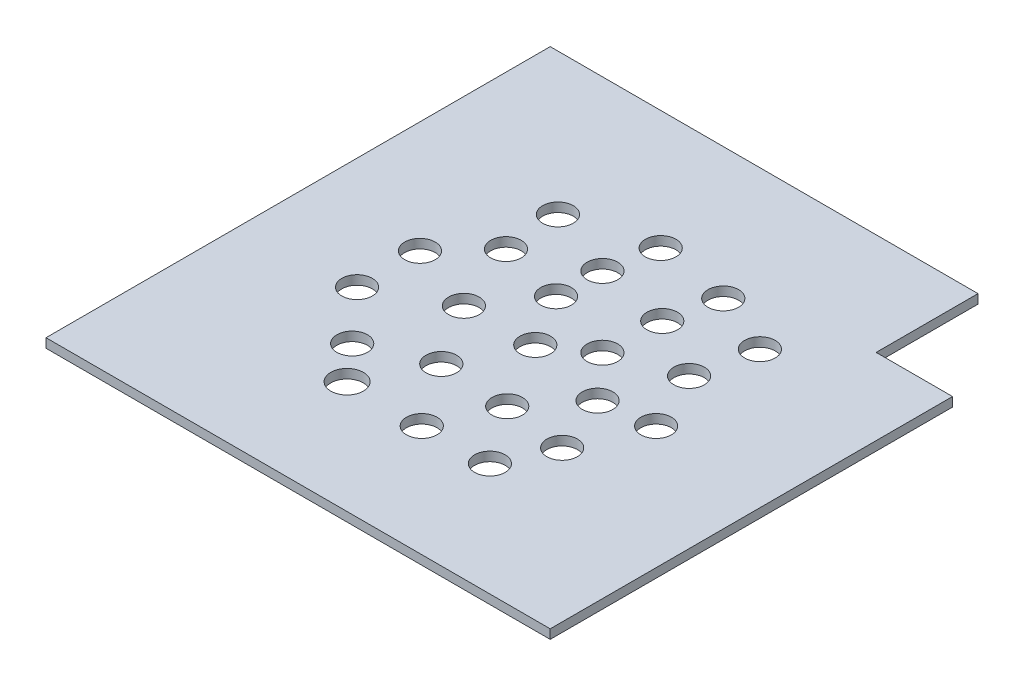
ISO-10303-21;
HEADER;
FILE_DESCRIPTION(('STEP AP214'),'2;1');
FILE_NAME('part.step','',(''),(''),'','','');
FILE_SCHEMA(('AUTOMOTIVE_DESIGN { 1 0 10303 214 1 1 1 1 }'));
ENDSEC;
DATA;
#1=APPLICATION_CONTEXT('core data for automotive mechanical design processes');
#2=APPLICATION_PROTOCOL_DEFINITION('international standard','automotive_design',2000,#1);
#3=PRODUCT_CONTEXT('',#1,'mechanical');
#4=PRODUCT('Part','Part','',(#3));
#5=PRODUCT_RELATED_PRODUCT_CATEGORY('part','',(#4));
#6=PRODUCT_DEFINITION_FORMATION('','',#4);
#7=PRODUCT_DEFINITION_CONTEXT('part definition',#1,'design');
#8=PRODUCT_DEFINITION('design','',#6,#7);
#9=PRODUCT_DEFINITION_SHAPE('','',#8);
#10=(LENGTH_UNIT() NAMED_UNIT(*) SI_UNIT(.MILLI.,.METRE.));
#11=(NAMED_UNIT(*) PLANE_ANGLE_UNIT() SI_UNIT($,.RADIAN.));
#12=(NAMED_UNIT(*) SI_UNIT($,.STERADIAN.) SOLID_ANGLE_UNIT());
#13=UNCERTAINTY_MEASURE_WITH_UNIT(LENGTH_MEASURE(1.E-05),#10,'distance_accuracy_value','');
#14=(GEOMETRIC_REPRESENTATION_CONTEXT(3) GLOBAL_UNCERTAINTY_ASSIGNED_CONTEXT((#13)) GLOBAL_UNIT_ASSIGNED_CONTEXT((#10,
#11,#12)) REPRESENTATION_CONTEXT('',''));
#15=CARTESIAN_POINT('',(0.,0.,0.));
#16=DIRECTION('',(0.,0.,1.));
#17=DIRECTION('',(1.,0.,0.));
#18=AXIS2_PLACEMENT_3D('',#15,#16,#17);
#19=CARTESIAN_POINT('',(0.,1.8,0.));
#20=DIRECTION('',(1.,0.,0.));
#21=DIRECTION('',(0.,0.,-1.));
#22=AXIS2_PLACEMENT_3D('',#19,#20,#21);
#23=PLANE('',#22);
#24=DIRECTION('',(0.,0.,1.));
#25=VECTOR('',#24,1.);
#26=CARTESIAN_POINT('',(0.,0.,0.));
#27=LINE('',#26,#25);
#28=CARTESIAN_POINT('',(0.,0.,-99.));
#29=VERTEX_POINT('',#28);
#30=CARTESIAN_POINT('',(0.,0.,0.));
#31=VERTEX_POINT('',#30);
#32=EDGE_CURVE('E109',#29,#31,#27,.T.);
#33=ORIENTED_EDGE('',*,*,#32,.T.);
#34=DIRECTION('',(0.,-1.,0.));
#35=VECTOR('',#34,1.);
#36=CARTESIAN_POINT('',(0.,1.8,0.));
#37=LINE('',#36,#35);
#38=CARTESIAN_POINT('',(0.,1.8,0.));
#39=VERTEX_POINT('',#38);
#40=EDGE_CURVE('E11',#39,#31,#37,.T.);
#41=ORIENTED_EDGE('',*,*,#40,.F.);
#42=DIRECTION('',(0.,0.,1.));
#43=VECTOR('',#42,1.);
#44=CARTESIAN_POINT('',(0.,1.8,0.));
#45=LINE('',#44,#43);
#46=CARTESIAN_POINT('',(0.,1.8,-99.));
#47=VERTEX_POINT('',#46);
#48=EDGE_CURVE('E110',#47,#39,#45,.T.);
#49=ORIENTED_EDGE('',*,*,#48,.F.);
#50=DIRECTION('',(0.,-1.,0.));
#51=VECTOR('',#50,1.);
#52=CARTESIAN_POINT('',(0.,1.8,-99.));
#53=LINE('',#52,#51);
#54=EDGE_CURVE('E119',#47,#29,#53,.T.);
#55=ORIENTED_EDGE('',*,*,#54,.T.);
#56=EDGE_LOOP('',(#33,#41,#49,#55));
#57=FACE_BOUND('',#56,.T.);
#58=ADVANCED_FACE('F34',(#57),#23,.F.);
#59=CARTESIAN_POINT('',(0.,1.8,0.));
#60=DIRECTION('',(0.,0.,-1.));
#61=DIRECTION('',(-1.,0.,0.));
#62=AXIS2_PLACEMENT_3D('',#59,#60,#61);
#63=PLANE('',#62);
#64=DIRECTION('',(1.,0.,0.));
#65=VECTOR('',#64,1.);
#66=CARTESIAN_POINT('',(0.,0.,0.));
#67=LINE('',#66,#65);
#68=CARTESIAN_POINT('',(99.,0.,0.));
#69=VERTEX_POINT('',#68);
#70=EDGE_CURVE('E115',#31,#69,#67,.T.);
#71=ORIENTED_EDGE('',*,*,#70,.T.);
#72=DIRECTION('',(0.,-1.,0.));
#73=VECTOR('',#72,1.);
#74=CARTESIAN_POINT('',(99.,1.8,0.));
#75=LINE('',#74,#73);
#76=CARTESIAN_POINT('',(99.,1.8,0.));
#77=VERTEX_POINT('',#76);
#78=EDGE_CURVE('E41',#77,#69,#75,.T.);
#79=ORIENTED_EDGE('',*,*,#78,.F.);
#80=DIRECTION('',(1.,0.,0.));
#81=VECTOR('',#80,1.);
#82=CARTESIAN_POINT('',(0.,1.8,0.));
#83=LINE('',#82,#81);
#84=EDGE_CURVE('E80',#39,#77,#83,.T.);
#85=ORIENTED_EDGE('',*,*,#84,.F.);
#86=ORIENTED_EDGE('',*,*,#40,.T.);
#87=EDGE_LOOP('',(#71,#79,#85,#86));
#88=FACE_BOUND('',#87,.T.);
#89=ADVANCED_FACE('F277',(#88),#63,.F.);
#90=CARTESIAN_POINT('',(99.,1.8,0.));
#91=DIRECTION('',(-1.,0.,0.));
#92=DIRECTION('',(0.,0.,1.));
#93=AXIS2_PLACEMENT_3D('',#90,#91,#92);
#94=PLANE('',#93);
#95=DIRECTION('',(0.,0.,-1.));
#96=VECTOR('',#95,1.);
#97=CARTESIAN_POINT('',(99.,0.,0.));
#98=LINE('',#97,#96);
#99=CARTESIAN_POINT('',(99.,0.,-79.));
#100=VERTEX_POINT('',#99);
#101=EDGE_CURVE('E111',#69,#100,#98,.T.);
#102=ORIENTED_EDGE('',*,*,#101,.T.);
#103=DIRECTION('',(0.,1.,0.));
#104=VECTOR('',#103,1.);
#105=CARTESIAN_POINT('',(99.,0.,-79.));
#106=LINE('',#105,#104);
#107=CARTESIAN_POINT('',(99.,1.8,-79.));
#108=VERTEX_POINT('',#107);
#109=EDGE_CURVE('E133',#100,#108,#106,.T.);
#110=ORIENTED_EDGE('',*,*,#109,.T.);
#111=DIRECTION('',(0.,0.,-1.));
#112=VECTOR('',#111,1.);
#113=CARTESIAN_POINT('',(99.,1.8,0.));
#114=LINE('',#113,#112);
#115=EDGE_CURVE('E127',#77,#108,#114,.T.);
#116=ORIENTED_EDGE('',*,*,#115,.F.);
#117=ORIENTED_EDGE('',*,*,#78,.T.);
#118=EDGE_LOOP('',(#102,#110,#116,#117));
#119=FACE_BOUND('',#118,.T.);
#120=ADVANCED_FACE('F124',(#119),#94,.F.);
#121=CARTESIAN_POINT('',(0.,1.8,-99.));
#122=DIRECTION('',(0.,0.,1.));
#123=DIRECTION('',(1.,0.,0.));
#124=AXIS2_PLACEMENT_3D('',#121,#122,#123);
#125=PLANE('',#124);
#126=DIRECTION('',(-1.,0.,0.));
#127=VECTOR('',#126,1.);
#128=CARTESIAN_POINT('',(0.,1.8,-99.));
#129=LINE('',#128,#127);
#130=CARTESIAN_POINT('',(84.,1.8,-99.));
#131=VERTEX_POINT('',#130);
#132=EDGE_CURVE('E57',#131,#47,#129,.T.);
#133=ORIENTED_EDGE('',*,*,#132,.F.);
#134=DIRECTION('',(0.,1.,0.));
#135=VECTOR('',#134,1.);
#136=CARTESIAN_POINT('',(84.,0.,-99.));
#137=LINE('',#136,#135);
#138=CARTESIAN_POINT('',(84.,0.,-99.));
#139=VERTEX_POINT('',#138);
#140=EDGE_CURVE('E98',#139,#131,#137,.T.);
#141=ORIENTED_EDGE('',*,*,#140,.F.);
#142=DIRECTION('',(-1.,0.,0.));
#143=VECTOR('',#142,1.);
#144=CARTESIAN_POINT('',(0.,0.,-99.));
#145=LINE('',#144,#143);
#146=EDGE_CURVE('E75',#139,#29,#145,.T.);
#147=ORIENTED_EDGE('',*,*,#146,.T.);
#148=ORIENTED_EDGE('',*,*,#54,.F.);
#149=EDGE_LOOP('',(#133,#141,#147,#148));
#150=FACE_BOUND('',#149,.T.);
#151=ADVANCED_FACE('F103',(#150),#125,.F.);
#152=CARTESIAN_POINT('',(0.,1.8,0.));
#153=DIRECTION('',(0.,-1.,0.));
#154=DIRECTION('',(0.,0.,-1.));
#155=AXIS2_PLACEMENT_3D('',#152,#153,#154);
#156=PLANE('',#155);
#157=CARTESIAN_POINT('',(57.1772812034631,1.8,-52.0793048172481));
#158=DIRECTION('',(0.,1.,0.));
#159=DIRECTION('',(0.,0.,1.));
#160=AXIS2_PLACEMENT_3D('',#157,#158,#159);
#161=CIRCLE('',#160,3.);
#162=CARTESIAN_POINT('',(57.1772812034631,1.8,-49.0793048172481));
#163=VERTEX_POINT('',#162);
#164=EDGE_CURVE('E135',#163,#163,#161,.T.);
#165=ORIENTED_EDGE('',*,*,#164,.F.);
#166=EDGE_LOOP('',(#165));
#167=FACE_BOUND('',#166,.T.);
#168=CARTESIAN_POINT('',(72.0381119260153,1.8,-68.1385896303287));
#169=DIRECTION('',(0.,1.,0.));
#170=DIRECTION('',(0.,0.,1.));
#171=AXIS2_PLACEMENT_3D('',#168,#169,#170);
#172=CIRCLE('',#171,2.99999999999999);
#173=CARTESIAN_POINT('',(72.0381119260153,1.8,-65.1385896303287));
#174=VERTEX_POINT('',#173);
#175=EDGE_CURVE('E140',#174,#174,#172,.T.);
#176=ORIENTED_EDGE('',*,*,#175,.F.);
#177=EDGE_LOOP('',(#176));
#178=FACE_BOUND('',#177,.T.);
#179=CARTESIAN_POINT('',(37.0432524825859,1.8,-22.0761361103538));
#180=DIRECTION('',(0.,1.,0.));
#181=DIRECTION('',(0.,0.,1.));
#182=AXIS2_PLACEMENT_3D('',#179,#180,#181);
#183=CIRCLE('',#182,3.19787437442162);
#184=CARTESIAN_POINT('',(37.0432524825859,1.8,-18.8782617359322));
#185=VERTEX_POINT('',#184);
#186=EDGE_CURVE('E146',#185,#185,#183,.T.);
#187=ORIENTED_EDGE('',*,*,#186,.F.);
#188=EDGE_LOOP('',(#187));
#189=FACE_BOUND('',#188,.T.);
#190=CARTESIAN_POINT('',(64.9865654797811,1.8,-22.175939832798));
#191=DIRECTION('',(0.,1.,0.));
#192=DIRECTION('',(0.,0.,1.));
#193=AXIS2_PLACEMENT_3D('',#190,#191,#192);
#194=CIRCLE('',#193,2.99999999999999);
#195=CARTESIAN_POINT('',(64.9865654797811,1.8,-19.175939832798));
#196=VERTEX_POINT('',#195);
#197=EDGE_CURVE('E152',#196,#196,#194,.T.);
#198=ORIENTED_EDGE('',*,*,#197,.F.);
#199=EDGE_LOOP('',(#198));
#200=FACE_BOUND('',#199,.T.);
#201=CARTESIAN_POINT('',(74.9144017432835,1.8,-44.8885802740776));
#202=DIRECTION('',(0.,1.,0.));
#203=DIRECTION('',(0.,0.,1.));
#204=AXIS2_PLACEMENT_3D('',#201,#202,#203);
#205=CIRCLE('',#204,2.99999999999999);
#206=CARTESIAN_POINT('',(74.9144017432835,1.8,-41.8885802740776));
#207=VERTEX_POINT('',#206);
#208=EDGE_CURVE('E158',#207,#207,#205,.T.);
#209=ORIENTED_EDGE('',*,*,#208,.F.);
#210=EDGE_LOOP('',(#209));
#211=FACE_BOUND('',#210,.T.);
#212=CARTESIAN_POINT('',(21.942730941928,1.8,-51.4839425456628));
#213=DIRECTION('',(0.,1.,0.));
#214=DIRECTION('',(0.,0.,1.));
#215=AXIS2_PLACEMENT_3D('',#212,#213,#214);
#216=CIRCLE('',#215,3.);
#217=CARTESIAN_POINT('',(21.942730941928,1.8,-48.4839425456628));
#218=VERTEX_POINT('',#217);
#219=EDGE_CURVE('E164',#218,#218,#216,.T.);
#220=ORIENTED_EDGE('',*,*,#219,.F.);
#221=EDGE_LOOP('',(#220));
#222=FACE_BOUND('',#221,.T.);
#223=CARTESIAN_POINT('',(21.942730941928,1.8,-39.1360006395413));
#224=DIRECTION('',(0.,1.,0.));
#225=DIRECTION('',(0.,0.,1.));
#226=AXIS2_PLACEMENT_3D('',#223,#224,#225);
#227=CIRCLE('',#226,3.);
#228=CARTESIAN_POINT('',(21.942730941928,1.8,-36.1360006395413));
#229=VERTEX_POINT('',#228);
#230=EDGE_CURVE('E170',#229,#229,#227,.T.);
#231=ORIENTED_EDGE('',*,*,#230,.F.);
#232=EDGE_LOOP('',(#231));
#233=FACE_BOUND('',#232,.T.);
#234=CARTESIAN_POINT('',(51.9040832051381,1.8,-21.8782617359322));
#235=DIRECTION('',(0.,1.,0.));
#236=DIRECTION('',(0.,0.,1.));
#237=AXIS2_PLACEMENT_3D('',#234,#235,#236);
#238=CIRCLE('',#237,3.);
#239=CARTESIAN_POINT('',(51.9040832051381,1.8,-18.8782617359322));
#240=VERTEX_POINT('',#239);
#241=EDGE_CURVE('E176',#240,#240,#238,.T.);
#242=ORIENTED_EDGE('',*,*,#241,.F.);
#243=EDGE_LOOP('',(#242));
#244=FACE_BOUND('',#243,.T.);
#245=CARTESIAN_POINT('',(31.0509820299439,1.8,-29.0689862791027));
#246=DIRECTION('',(0.,1.,0.));
#247=DIRECTION('',(0.,0.,1.));
#248=AXIS2_PLACEMENT_3D('',#245,#246,#247);
#249=CIRCLE('',#248,3.);
#250=CARTESIAN_POINT('',(31.0509820299439,1.8,-26.0689862791027));
#251=VERTEX_POINT('',#250);
#252=EDGE_CURVE('E182',#251,#251,#249,.T.);
#253=ORIENTED_EDGE('',*,*,#252,.F.);
#254=EDGE_LOOP('',(#253));
#255=FACE_BOUND('',#254,.T.);
#256=CARTESIAN_POINT('',(69.4015129268528,1.8,-31.9452760963708));
#257=DIRECTION('',(0.,1.,0.));
#258=DIRECTION('',(0.,0.,1.));
#259=AXIS2_PLACEMENT_3D('',#256,#257,#258);
#260=CIRCLE('',#259,2.99999999999999);
#261=CARTESIAN_POINT('',(69.4015129268528,1.8,-28.9452760963708));
#262=VERTEX_POINT('',#261);
#263=EDGE_CURVE('E188',#262,#262,#260,.T.);
#264=ORIENTED_EDGE('',*,*,#263,.F.);
#265=EDGE_LOOP('',(#264));
#266=FACE_BOUND('',#265,.T.);
#267=CARTESIAN_POINT('',(59.8138802026256,1.8,-73.172096810548));
#268=DIRECTION('',(0.,1.,0.));
#269=DIRECTION('',(0.,0.,1.));
#270=AXIS2_PLACEMENT_3D('',#267,#268,#269);
#271=CIRCLE('',#270,2.99999999999999);
#272=CARTESIAN_POINT('',(59.8138802026256,1.8,-70.172096810548));
#273=VERTEX_POINT('',#272);
#274=EDGE_CURVE('E194',#273,#273,#271,.T.);
#275=ORIENTED_EDGE('',*,*,#274,.F.);
#276=EDGE_LOOP('',(#275));
#277=FACE_BOUND('',#276,.T.);
#278=CARTESIAN_POINT('',(43.2752137533336,1.8,-65.9813722673776));
#279=DIRECTION('',(0.,1.,0.));
#280=DIRECTION('',(0.,0.,1.));
#281=AXIS2_PLACEMENT_3D('',#278,#279,#280);
#282=CIRCLE('',#281,3.);
#283=CARTESIAN_POINT('',(43.2752137533336,1.8,-62.9813722673776));
#284=VERTEX_POINT('',#283);
#285=EDGE_CURVE('E200',#284,#284,#282,.T.);
#286=ORIENTED_EDGE('',*,*,#285,.F.);
#287=EDGE_LOOP('',(#286));
#288=FACE_BOUND('',#287,.T.);
#289=CARTESIAN_POINT('',(43.0355229352279,1.8,-57.1128119974674));
#290=DIRECTION('',(0.,1.,0.));
#291=DIRECTION('',(0.,0.,1.));
#292=AXIS2_PLACEMENT_3D('',#289,#290,#291);
#293=CIRCLE('',#292,3.);
#294=CARTESIAN_POINT('',(43.0355229352279,1.8,-54.1128119974674));
#295=VERTEX_POINT('',#294);
#296=EDGE_CURVE('E206',#295,#295,#293,.T.);
#297=ORIENTED_EDGE('',*,*,#296,.F.);
#298=EDGE_LOOP('',(#297));
#299=FACE_BOUND('',#298,.T.);
#300=CARTESIAN_POINT('',(57.6566628396745,1.8,-63.3447732682151));
#301=DIRECTION('',(0.,1.,0.));
#302=DIRECTION('',(0.,0.,1.));
#303=AXIS2_PLACEMENT_3D('',#300,#301,#302);
#304=CIRCLE('',#303,3.);
#305=CARTESIAN_POINT('',(57.6566628396745,1.8,-60.3447732682151));
#306=VERTEX_POINT('',#305);
#307=EDGE_CURVE('E212',#306,#306,#304,.T.);
#308=ORIENTED_EDGE('',*,*,#307,.F.);
#309=EDGE_LOOP('',(#308));
#310=FACE_BOUND('',#309,.T.);
#311=CARTESIAN_POINT('',(69.6412037449585,1.8,-56.633430361256));
#312=DIRECTION('',(0.,1.,0.));
#313=DIRECTION('',(0.,0.,1.));
#314=AXIS2_PLACEMENT_3D('',#311,#312,#313);
#315=CIRCLE('',#314,2.99999999999999);
#316=CARTESIAN_POINT('',(69.6412037449585,1.8,-53.633430361256));
#317=VERTEX_POINT('',#316);
#318=EDGE_CURVE('E218',#317,#317,#315,.T.);
#319=ORIENTED_EDGE('',*,*,#318,.F.);
#320=EDGE_LOOP('',(#319));
#321=FACE_BOUND('',#320,.T.);
#322=CARTESIAN_POINT('',(64.8473873828449,1.8,-43.4504353654435));
#323=DIRECTION('',(0.,1.,0.));
#324=DIRECTION('',(0.,0.,1.));
#325=AXIS2_PLACEMENT_3D('',#322,#323,#324);
#326=CIRCLE('',#325,2.99999999999999);
#327=CARTESIAN_POINT('',(64.8473873828449,1.8,-40.4504353654435));
#328=VERTEX_POINT('',#327);
#329=EDGE_CURVE('E224',#328,#328,#326,.T.);
#330=ORIENTED_EDGE('',*,*,#329,.F.);
#331=EDGE_LOOP('',(#330));
#332=FACE_BOUND('',#331,.T.);
#333=CARTESIAN_POINT('',(49.2674842059756,1.8,-46.8061068189231));
#334=DIRECTION('',(0.,1.,0.));
#335=DIRECTION('',(0.,0.,1.));
#336=AXIS2_PLACEMENT_3D('',#333,#334,#335);
#337=CIRCLE('',#336,3.);
#338=CARTESIAN_POINT('',(49.2674842059756,1.8,-43.8061068189231));
#339=VERTEX_POINT('',#338);
#340=EDGE_CURVE('E230',#339,#339,#337,.T.);
#341=ORIENTED_EDGE('',*,*,#340,.F.);
#342=EDGE_LOOP('',(#341));
#343=FACE_BOUND('',#342,.T.);
#344=CARTESIAN_POINT('',(56.9375903853574,1.8,-33.6231118231106));
#345=DIRECTION('',(0.,1.,0.));
#346=DIRECTION('',(0.,0.,1.));
#347=AXIS2_PLACEMENT_3D('',#344,#345,#346);
#348=CIRCLE('',#347,3.);
#349=CARTESIAN_POINT('',(56.9375903853574,1.8,-30.6231118231106));
#350=VERTEX_POINT('',#349);
#351=EDGE_CURVE('E236',#350,#350,#348,.T.);
#352=ORIENTED_EDGE('',*,*,#351,.F.);
#353=EDGE_LOOP('',(#352));
#354=FACE_BOUND('',#353,.T.);
#355=CARTESIAN_POINT('',(43.2752137533336,1.8,-34.3421842774276));
#356=DIRECTION('',(0.,1.,0.));
#357=DIRECTION('',(0.,0.,1.));
#358=AXIS2_PLACEMENT_3D('',#355,#356,#357);
#359=CIRCLE('',#358,3.);
#360=CARTESIAN_POINT('',(43.2752137533336,1.8,-31.3421842774276));
#361=VERTEX_POINT('',#360);
#362=EDGE_CURVE('E242',#361,#361,#359,.T.);
#363=ORIENTED_EDGE('',*,*,#362,.F.);
#364=EDGE_LOOP('',(#363));
#365=FACE_BOUND('',#364,.T.);
#366=CARTESIAN_POINT('',(35.6051075739518,1.8,-46.4504353654435));
#367=DIRECTION('',(0.,1.,0.));
#368=DIRECTION('',(0.,0.,1.));
#369=AXIS2_PLACEMENT_3D('',#366,#367,#368);
#370=CIRCLE('',#369,3.);
#371=CARTESIAN_POINT('',(35.6051075739518,1.8,-43.4504353654435));
#372=VERTEX_POINT('',#371);
#373=EDGE_CURVE('E248',#372,#372,#370,.T.);
#374=ORIENTED_EDGE('',*,*,#373,.F.);
#375=EDGE_LOOP('',(#374));
#376=FACE_BOUND('',#375,.T.);
#377=CARTESIAN_POINT('',(30.0922187575211,1.8,-60.2287926328412));
#378=DIRECTION('',(0.,1.,0.));
#379=DIRECTION('',(0.,0.,1.));
#380=AXIS2_PLACEMENT_3D('',#377,#378,#379);
#381=CIRCLE('',#380,3.);
#382=CARTESIAN_POINT('',(30.0922187575211,1.8,-57.2287926328412));
#383=VERTEX_POINT('',#382);
#384=EDGE_CURVE('E254',#383,#383,#381,.T.);
#385=ORIENTED_EDGE('',*,*,#384,.F.);
#386=EDGE_LOOP('',(#385));
#387=FACE_BOUND('',#386,.T.);
#388=CARTESIAN_POINT('',(45.1020037274879,1.8,-75.5953491764315));
#389=DIRECTION('',(0.,1.,0.));
#390=DIRECTION('',(0.,0.,1.));
#391=AXIS2_PLACEMENT_3D('',#388,#389,#390);
#392=CIRCLE('',#391,3.);
#393=CARTESIAN_POINT('',(45.1020037274879,1.8,-72.5953491764315));
#394=VERTEX_POINT('',#393);
#395=EDGE_CURVE('E260',#394,#394,#392,.T.);
#396=ORIENTED_EDGE('',*,*,#395,.F.);
#397=EDGE_LOOP('',(#396));
#398=FACE_BOUND('',#397,.T.);
#399=CARTESIAN_POINT('',(29.2981893401239,1.8,-71.224140527953));
#400=DIRECTION('',(0.,1.,0.));
#401=DIRECTION('',(0.,0.,1.));
#402=AXIS2_PLACEMENT_3D('',#399,#400,#401);
#403=CIRCLE('',#402,3.);
#404=CARTESIAN_POINT('',(29.2981893401239,1.8,-68.224140527953));
#405=VERTEX_POINT('',#404);
#406=EDGE_CURVE('E266',#405,#405,#403,.T.);
#407=ORIENTED_EDGE('',*,*,#406,.F.);
#408=EDGE_LOOP('',(#407));
#409=FACE_BOUND('',#408,.T.);
#410=ORIENTED_EDGE('',*,*,#115,.T.);
#411=DIRECTION('',(1.,0.,0.));
#412=VECTOR('',#411,1.);
#413=CARTESIAN_POINT('',(99.,1.8,-79.));
#414=LINE('',#413,#412);
#415=CARTESIAN_POINT('',(84.,1.8,-79.));
#416=VERTEX_POINT('',#415);
#417=EDGE_CURVE('E101',#416,#108,#414,.T.);
#418=ORIENTED_EDGE('',*,*,#417,.F.);
#419=DIRECTION('',(0.,0.,1.));
#420=VECTOR('',#419,1.);
#421=CARTESIAN_POINT('',(84.,1.8,-99.));
#422=LINE('',#421,#420);
#423=EDGE_CURVE('E130',#131,#416,#422,.T.);
#424=ORIENTED_EDGE('',*,*,#423,.F.);
#425=ORIENTED_EDGE('',*,*,#132,.T.);
#426=ORIENTED_EDGE('',*,*,#48,.T.);
#427=ORIENTED_EDGE('',*,*,#84,.T.);
#428=EDGE_LOOP('',(#410,#418,#424,#425,#426,#427));
#429=FACE_BOUND('',#428,.T.);
#430=ADVANCED_FACE('F281',(#167,#178,#189,#200,#211,#222,#233,#244,#255,#266,#277,#288,#299,
#310,#321,#332,#343,#354,#365,#376,#387,#398,#409,#429),#156,.F.);
#431=CARTESIAN_POINT('',(0.,0.,0.));
#432=DIRECTION('',(0.,-1.,0.));
#433=DIRECTION('',(0.,0.,-1.));
#434=AXIS2_PLACEMENT_3D('',#431,#432,#433);
#435=PLANE('',#434);
#436=DIRECTION('',(1.,0.,0.));
#437=VECTOR('',#436,1.);
#438=CARTESIAN_POINT('',(99.,0.,-79.));
#439=LINE('',#438,#437);
#440=CARTESIAN_POINT('',(84.,0.,-79.));
#441=VERTEX_POINT('',#440);
#442=EDGE_CURVE('E48',#441,#100,#439,.T.);
#443=ORIENTED_EDGE('',*,*,#442,.T.);
#444=ORIENTED_EDGE('',*,*,#101,.F.);
#445=ORIENTED_EDGE('',*,*,#70,.F.);
#446=ORIENTED_EDGE('',*,*,#32,.F.);
#447=ORIENTED_EDGE('',*,*,#146,.F.);
#448=DIRECTION('',(0.,0.,1.));
#449=VECTOR('',#448,1.);
#450=CARTESIAN_POINT('',(84.,0.,-99.));
#451=LINE('',#450,#449);
#452=EDGE_CURVE('E95',#139,#441,#451,.T.);
#453=ORIENTED_EDGE('',*,*,#452,.T.);
#454=EDGE_LOOP('',(#443,#444,#445,#446,#447,#453));
#455=FACE_BOUND('',#454,.T.);
#456=CARTESIAN_POINT('',(57.1772812034631,0.,-52.0793048172481));
#457=DIRECTION('',(0.,1.,0.));
#458=DIRECTION('',(0.,0.,1.));
#459=AXIS2_PLACEMENT_3D('',#456,#457,#458);
#460=CIRCLE('',#459,3.);
#461=CARTESIAN_POINT('',(57.1772812034631,0.,-49.0793048172481));
#462=VERTEX_POINT('',#461);
#463=EDGE_CURVE('E137',#462,#462,#460,.T.);
#464=ORIENTED_EDGE('',*,*,#463,.T.);
#465=EDGE_LOOP('',(#464));
#466=FACE_BOUND('',#465,.T.);
#467=CARTESIAN_POINT('',(72.0381119260153,0.,-68.1385896303287));
#468=DIRECTION('',(0.,1.,0.));
#469=DIRECTION('',(0.,0.,1.));
#470=AXIS2_PLACEMENT_3D('',#467,#468,#469);
#471=CIRCLE('',#470,2.99999999999999);
#472=CARTESIAN_POINT('',(72.0381119260153,0.,-65.1385896303287));
#473=VERTEX_POINT('',#472);
#474=EDGE_CURVE('E143',#473,#473,#471,.T.);
#475=ORIENTED_EDGE('',*,*,#474,.T.);
#476=EDGE_LOOP('',(#475));
#477=FACE_BOUND('',#476,.T.);
#478=CARTESIAN_POINT('',(37.0432524825859,0.,-22.0761361103538));
#479=DIRECTION('',(0.,1.,0.));
#480=DIRECTION('',(0.,0.,1.));
#481=AXIS2_PLACEMENT_3D('',#478,#479,#480);
#482=CIRCLE('',#481,3.19787437442162);
#483=CARTESIAN_POINT('',(37.0432524825859,0.,-18.8782617359322));
#484=VERTEX_POINT('',#483);
#485=EDGE_CURVE('E149',#484,#484,#482,.T.);
#486=ORIENTED_EDGE('',*,*,#485,.T.);
#487=EDGE_LOOP('',(#486));
#488=FACE_BOUND('',#487,.T.);
#489=CARTESIAN_POINT('',(64.9865654797811,0.,-22.175939832798));
#490=DIRECTION('',(0.,1.,0.));
#491=DIRECTION('',(0.,0.,1.));
#492=AXIS2_PLACEMENT_3D('',#489,#490,#491);
#493=CIRCLE('',#492,2.99999999999999);
#494=CARTESIAN_POINT('',(64.9865654797811,0.,-19.175939832798));
#495=VERTEX_POINT('',#494);
#496=EDGE_CURVE('E155',#495,#495,#493,.T.);
#497=ORIENTED_EDGE('',*,*,#496,.T.);
#498=EDGE_LOOP('',(#497));
#499=FACE_BOUND('',#498,.T.);
#500=CARTESIAN_POINT('',(74.9144017432835,0.,-44.8885802740776));
#501=DIRECTION('',(0.,1.,0.));
#502=DIRECTION('',(0.,0.,1.));
#503=AXIS2_PLACEMENT_3D('',#500,#501,#502);
#504=CIRCLE('',#503,2.99999999999999);
#505=CARTESIAN_POINT('',(74.9144017432835,0.,-41.8885802740776));
#506=VERTEX_POINT('',#505);
#507=EDGE_CURVE('E161',#506,#506,#504,.T.);
#508=ORIENTED_EDGE('',*,*,#507,.T.);
#509=EDGE_LOOP('',(#508));
#510=FACE_BOUND('',#509,.T.);
#511=CARTESIAN_POINT('',(21.942730941928,0.,-51.4839425456628));
#512=DIRECTION('',(0.,1.,0.));
#513=DIRECTION('',(0.,0.,1.));
#514=AXIS2_PLACEMENT_3D('',#511,#512,#513);
#515=CIRCLE('',#514,3.);
#516=CARTESIAN_POINT('',(21.942730941928,0.,-48.4839425456628));
#517=VERTEX_POINT('',#516);
#518=EDGE_CURVE('E167',#517,#517,#515,.T.);
#519=ORIENTED_EDGE('',*,*,#518,.T.);
#520=EDGE_LOOP('',(#519));
#521=FACE_BOUND('',#520,.T.);
#522=CARTESIAN_POINT('',(21.942730941928,0.,-39.1360006395413));
#523=DIRECTION('',(0.,1.,0.));
#524=DIRECTION('',(0.,0.,1.));
#525=AXIS2_PLACEMENT_3D('',#522,#523,#524);
#526=CIRCLE('',#525,3.);
#527=CARTESIAN_POINT('',(21.942730941928,0.,-36.1360006395413));
#528=VERTEX_POINT('',#527);
#529=EDGE_CURVE('E173',#528,#528,#526,.T.);
#530=ORIENTED_EDGE('',*,*,#529,.T.);
#531=EDGE_LOOP('',(#530));
#532=FACE_BOUND('',#531,.T.);
#533=CARTESIAN_POINT('',(51.9040832051381,0.,-21.8782617359322));
#534=DIRECTION('',(0.,1.,0.));
#535=DIRECTION('',(0.,0.,1.));
#536=AXIS2_PLACEMENT_3D('',#533,#534,#535);
#537=CIRCLE('',#536,3.);
#538=CARTESIAN_POINT('',(51.9040832051381,0.,-18.8782617359322));
#539=VERTEX_POINT('',#538);
#540=EDGE_CURVE('E179',#539,#539,#537,.T.);
#541=ORIENTED_EDGE('',*,*,#540,.T.);
#542=EDGE_LOOP('',(#541));
#543=FACE_BOUND('',#542,.T.);
#544=CARTESIAN_POINT('',(31.0509820299439,0.,-29.0689862791027));
#545=DIRECTION('',(0.,1.,0.));
#546=DIRECTION('',(0.,0.,1.));
#547=AXIS2_PLACEMENT_3D('',#544,#545,#546);
#548=CIRCLE('',#547,3.);
#549=CARTESIAN_POINT('',(31.0509820299439,0.,-26.0689862791027));
#550=VERTEX_POINT('',#549);
#551=EDGE_CURVE('E185',#550,#550,#548,.T.);
#552=ORIENTED_EDGE('',*,*,#551,.T.);
#553=EDGE_LOOP('',(#552));
#554=FACE_BOUND('',#553,.T.);
#555=CARTESIAN_POINT('',(69.4015129268528,0.,-31.9452760963708));
#556=DIRECTION('',(0.,1.,0.));
#557=DIRECTION('',(0.,0.,1.));
#558=AXIS2_PLACEMENT_3D('',#555,#556,#557);
#559=CIRCLE('',#558,2.99999999999999);
#560=CARTESIAN_POINT('',(69.4015129268528,0.,-28.9452760963708));
#561=VERTEX_POINT('',#560);
#562=EDGE_CURVE('E191',#561,#561,#559,.T.);
#563=ORIENTED_EDGE('',*,*,#562,.T.);
#564=EDGE_LOOP('',(#563));
#565=FACE_BOUND('',#564,.T.);
#566=CARTESIAN_POINT('',(59.8138802026256,0.,-73.172096810548));
#567=DIRECTION('',(0.,1.,0.));
#568=DIRECTION('',(0.,0.,1.));
#569=AXIS2_PLACEMENT_3D('',#566,#567,#568);
#570=CIRCLE('',#569,2.99999999999999);
#571=CARTESIAN_POINT('',(59.8138802026256,0.,-70.172096810548));
#572=VERTEX_POINT('',#571);
#573=EDGE_CURVE('E197',#572,#572,#570,.T.);
#574=ORIENTED_EDGE('',*,*,#573,.T.);
#575=EDGE_LOOP('',(#574));
#576=FACE_BOUND('',#575,.T.);
#577=CARTESIAN_POINT('',(43.2752137533336,0.,-65.9813722673776));
#578=DIRECTION('',(0.,1.,0.));
#579=DIRECTION('',(0.,0.,1.));
#580=AXIS2_PLACEMENT_3D('',#577,#578,#579);
#581=CIRCLE('',#580,3.);
#582=CARTESIAN_POINT('',(43.2752137533336,0.,-62.9813722673776));
#583=VERTEX_POINT('',#582);
#584=EDGE_CURVE('E203',#583,#583,#581,.T.);
#585=ORIENTED_EDGE('',*,*,#584,.T.);
#586=EDGE_LOOP('',(#585));
#587=FACE_BOUND('',#586,.T.);
#588=CARTESIAN_POINT('',(43.0355229352279,0.,-57.1128119974674));
#589=DIRECTION('',(0.,1.,0.));
#590=DIRECTION('',(0.,0.,1.));
#591=AXIS2_PLACEMENT_3D('',#588,#589,#590);
#592=CIRCLE('',#591,3.);
#593=CARTESIAN_POINT('',(43.0355229352279,0.,-54.1128119974674));
#594=VERTEX_POINT('',#593);
#595=EDGE_CURVE('E209',#594,#594,#592,.T.);
#596=ORIENTED_EDGE('',*,*,#595,.T.);
#597=EDGE_LOOP('',(#596));
#598=FACE_BOUND('',#597,.T.);
#599=CARTESIAN_POINT('',(57.6566628396745,0.,-63.3447732682151));
#600=DIRECTION('',(0.,1.,0.));
#601=DIRECTION('',(0.,0.,1.));
#602=AXIS2_PLACEMENT_3D('',#599,#600,#601);
#603=CIRCLE('',#602,3.);
#604=CARTESIAN_POINT('',(57.6566628396745,0.,-60.3447732682151));
#605=VERTEX_POINT('',#604);
#606=EDGE_CURVE('E215',#605,#605,#603,.T.);
#607=ORIENTED_EDGE('',*,*,#606,.T.);
#608=EDGE_LOOP('',(#607));
#609=FACE_BOUND('',#608,.T.);
#610=CARTESIAN_POINT('',(69.6412037449585,0.,-56.633430361256));
#611=DIRECTION('',(0.,1.,0.));
#612=DIRECTION('',(0.,0.,1.));
#613=AXIS2_PLACEMENT_3D('',#610,#611,#612);
#614=CIRCLE('',#613,2.99999999999999);
#615=CARTESIAN_POINT('',(69.6412037449585,0.,-53.633430361256));
#616=VERTEX_POINT('',#615);
#617=EDGE_CURVE('E221',#616,#616,#614,.T.);
#618=ORIENTED_EDGE('',*,*,#617,.T.);
#619=EDGE_LOOP('',(#618));
#620=FACE_BOUND('',#619,.T.);
#621=CARTESIAN_POINT('',(64.8473873828449,0.,-43.4504353654435));
#622=DIRECTION('',(0.,1.,0.));
#623=DIRECTION('',(0.,0.,1.));
#624=AXIS2_PLACEMENT_3D('',#621,#622,#623);
#625=CIRCLE('',#624,2.99999999999999);
#626=CARTESIAN_POINT('',(64.8473873828449,0.,-40.4504353654435));
#627=VERTEX_POINT('',#626);
#628=EDGE_CURVE('E227',#627,#627,#625,.T.);
#629=ORIENTED_EDGE('',*,*,#628,.T.);
#630=EDGE_LOOP('',(#629));
#631=FACE_BOUND('',#630,.T.);
#632=CARTESIAN_POINT('',(49.2674842059756,0.,-46.8061068189231));
#633=DIRECTION('',(0.,1.,0.));
#634=DIRECTION('',(0.,0.,1.));
#635=AXIS2_PLACEMENT_3D('',#632,#633,#634);
#636=CIRCLE('',#635,3.);
#637=CARTESIAN_POINT('',(49.2674842059756,0.,-43.8061068189231));
#638=VERTEX_POINT('',#637);
#639=EDGE_CURVE('E233',#638,#638,#636,.T.);
#640=ORIENTED_EDGE('',*,*,#639,.T.);
#641=EDGE_LOOP('',(#640));
#642=FACE_BOUND('',#641,.T.);
#643=CARTESIAN_POINT('',(56.9375903853574,0.,-33.6231118231106));
#644=DIRECTION('',(0.,1.,0.));
#645=DIRECTION('',(0.,0.,1.));
#646=AXIS2_PLACEMENT_3D('',#643,#644,#645);
#647=CIRCLE('',#646,3.);
#648=CARTESIAN_POINT('',(56.9375903853574,0.,-30.6231118231106));
#649=VERTEX_POINT('',#648);
#650=EDGE_CURVE('E239',#649,#649,#647,.T.);
#651=ORIENTED_EDGE('',*,*,#650,.T.);
#652=EDGE_LOOP('',(#651));
#653=FACE_BOUND('',#652,.T.);
#654=CARTESIAN_POINT('',(43.2752137533336,0.,-34.3421842774276));
#655=DIRECTION('',(0.,1.,0.));
#656=DIRECTION('',(0.,0.,1.));
#657=AXIS2_PLACEMENT_3D('',#654,#655,#656);
#658=CIRCLE('',#657,3.);
#659=CARTESIAN_POINT('',(43.2752137533336,0.,-31.3421842774276));
#660=VERTEX_POINT('',#659);
#661=EDGE_CURVE('E245',#660,#660,#658,.T.);
#662=ORIENTED_EDGE('',*,*,#661,.T.);
#663=EDGE_LOOP('',(#662));
#664=FACE_BOUND('',#663,.T.);
#665=CARTESIAN_POINT('',(35.6051075739518,0.,-46.4504353654435));
#666=DIRECTION('',(0.,1.,0.));
#667=DIRECTION('',(0.,0.,1.));
#668=AXIS2_PLACEMENT_3D('',#665,#666,#667);
#669=CIRCLE('',#668,3.);
#670=CARTESIAN_POINT('',(35.6051075739518,0.,-43.4504353654435));
#671=VERTEX_POINT('',#670);
#672=EDGE_CURVE('E251',#671,#671,#669,.T.);
#673=ORIENTED_EDGE('',*,*,#672,.T.);
#674=EDGE_LOOP('',(#673));
#675=FACE_BOUND('',#674,.T.);
#676=CARTESIAN_POINT('',(30.0922187575211,0.,-60.2287926328412));
#677=DIRECTION('',(0.,1.,0.));
#678=DIRECTION('',(0.,0.,1.));
#679=AXIS2_PLACEMENT_3D('',#676,#677,#678);
#680=CIRCLE('',#679,3.);
#681=CARTESIAN_POINT('',(30.0922187575211,0.,-57.2287926328412));
#682=VERTEX_POINT('',#681);
#683=EDGE_CURVE('E257',#682,#682,#680,.T.);
#684=ORIENTED_EDGE('',*,*,#683,.T.);
#685=EDGE_LOOP('',(#684));
#686=FACE_BOUND('',#685,.T.);
#687=CARTESIAN_POINT('',(45.1020037274879,0.,-75.5953491764315));
#688=DIRECTION('',(0.,1.,0.));
#689=DIRECTION('',(0.,0.,1.));
#690=AXIS2_PLACEMENT_3D('',#687,#688,#689);
#691=CIRCLE('',#690,3.);
#692=CARTESIAN_POINT('',(45.1020037274879,0.,-72.5953491764315));
#693=VERTEX_POINT('',#692);
#694=EDGE_CURVE('E263',#693,#693,#691,.T.);
#695=ORIENTED_EDGE('',*,*,#694,.T.);
#696=EDGE_LOOP('',(#695));
#697=FACE_BOUND('',#696,.T.);
#698=CARTESIAN_POINT('',(29.2981893401239,0.,-71.224140527953));
#699=DIRECTION('',(0.,1.,0.));
#700=DIRECTION('',(0.,0.,1.));
#701=AXIS2_PLACEMENT_3D('',#698,#699,#700);
#702=CIRCLE('',#701,3.);
#703=CARTESIAN_POINT('',(29.2981893401239,0.,-68.224140527953));
#704=VERTEX_POINT('',#703);
#705=EDGE_CURVE('E269',#704,#704,#702,.T.);
#706=ORIENTED_EDGE('',*,*,#705,.T.);
#707=EDGE_LOOP('',(#706));
#708=FACE_BOUND('',#707,.T.);
#709=ADVANCED_FACE('F106',(#455,#466,#477,#488,#499,#510,#521,#532,#543,#554,#565,#576,#587,
#598,#609,#620,#631,#642,#653,#664,#675,#686,#697,#708),#435,.T.);
#710=CARTESIAN_POINT('',(29.2981893401239,0.,-71.224140527953));
#711=DIRECTION('',(0.,1.,0.));
#712=DIRECTION('',(0.,0.,1.));
#713=AXIS2_PLACEMENT_3D('',#710,#711,#712);
#714=CYLINDRICAL_SURFACE('',#713,3.);
#715=ORIENTED_EDGE('',*,*,#705,.F.);
#716=EDGE_LOOP('',(#715));
#717=FACE_BOUND('',#716,.T.);
#718=ORIENTED_EDGE('',*,*,#406,.T.);
#719=EDGE_LOOP('',(#718));
#720=FACE_BOUND('',#719,.T.);
#721=ADVANCED_FACE('F309',(#717,#720),#714,.F.);
#722=CARTESIAN_POINT('',(45.1020037274879,0.,-75.5953491764315));
#723=DIRECTION('',(0.,1.,0.));
#724=DIRECTION('',(0.,0.,1.));
#725=AXIS2_PLACEMENT_3D('',#722,#723,#724);
#726=CYLINDRICAL_SURFACE('',#725,3.);
#727=ORIENTED_EDGE('',*,*,#694,.F.);
#728=EDGE_LOOP('',(#727));
#729=FACE_BOUND('',#728,.T.);
#730=ORIENTED_EDGE('',*,*,#395,.T.);
#731=EDGE_LOOP('',(#730));
#732=FACE_BOUND('',#731,.T.);
#733=ADVANCED_FACE('F315',(#729,#732),#726,.F.);
#734=CARTESIAN_POINT('',(30.0922187575211,0.,-60.2287926328412));
#735=DIRECTION('',(0.,1.,0.));
#736=DIRECTION('',(0.,0.,1.));
#737=AXIS2_PLACEMENT_3D('',#734,#735,#736);
#738=CYLINDRICAL_SURFACE('',#737,3.);
#739=ORIENTED_EDGE('',*,*,#683,.F.);
#740=EDGE_LOOP('',(#739));
#741=FACE_BOUND('',#740,.T.);
#742=ORIENTED_EDGE('',*,*,#384,.T.);
#743=EDGE_LOOP('',(#742));
#744=FACE_BOUND('',#743,.T.);
#745=ADVANCED_FACE('F319',(#741,#744),#738,.F.);
#746=CARTESIAN_POINT('',(35.6051075739518,0.,-46.4504353654435));
#747=DIRECTION('',(0.,1.,0.));
#748=DIRECTION('',(0.,0.,1.));
#749=AXIS2_PLACEMENT_3D('',#746,#747,#748);
#750=CYLINDRICAL_SURFACE('',#749,3.);
#751=ORIENTED_EDGE('',*,*,#672,.F.);
#752=EDGE_LOOP('',(#751));
#753=FACE_BOUND('',#752,.T.);
#754=ORIENTED_EDGE('',*,*,#373,.T.);
#755=EDGE_LOOP('',(#754));
#756=FACE_BOUND('',#755,.T.);
#757=ADVANCED_FACE('F323',(#753,#756),#750,.F.);
#758=CARTESIAN_POINT('',(43.2752137533336,0.,-34.3421842774276));
#759=DIRECTION('',(0.,1.,0.));
#760=DIRECTION('',(0.,0.,1.));
#761=AXIS2_PLACEMENT_3D('',#758,#759,#760);
#762=CYLINDRICAL_SURFACE('',#761,3.);
#763=ORIENTED_EDGE('',*,*,#661,.F.);
#764=EDGE_LOOP('',(#763));
#765=FACE_BOUND('',#764,.T.);
#766=ORIENTED_EDGE('',*,*,#362,.T.);
#767=EDGE_LOOP('',(#766));
#768=FACE_BOUND('',#767,.T.);
#769=ADVANCED_FACE('F327',(#765,#768),#762,.F.);
#770=CARTESIAN_POINT('',(56.9375903853574,0.,-33.6231118231106));
#771=DIRECTION('',(0.,1.,0.));
#772=DIRECTION('',(0.,0.,1.));
#773=AXIS2_PLACEMENT_3D('',#770,#771,#772);
#774=CYLINDRICAL_SURFACE('',#773,3.);
#775=ORIENTED_EDGE('',*,*,#650,.F.);
#776=EDGE_LOOP('',(#775));
#777=FACE_BOUND('',#776,.T.);
#778=ORIENTED_EDGE('',*,*,#351,.T.);
#779=EDGE_LOOP('',(#778));
#780=FACE_BOUND('',#779,.T.);
#781=ADVANCED_FACE('F331',(#777,#780),#774,.F.);
#782=CARTESIAN_POINT('',(49.2674842059756,0.,-46.8061068189231));
#783=DIRECTION('',(0.,1.,0.));
#784=DIRECTION('',(0.,0.,1.));
#785=AXIS2_PLACEMENT_3D('',#782,#783,#784);
#786=CYLINDRICAL_SURFACE('',#785,3.);
#787=ORIENTED_EDGE('',*,*,#639,.F.);
#788=EDGE_LOOP('',(#787));
#789=FACE_BOUND('',#788,.T.);
#790=ORIENTED_EDGE('',*,*,#340,.T.);
#791=EDGE_LOOP('',(#790));
#792=FACE_BOUND('',#791,.T.);
#793=ADVANCED_FACE('F335',(#789,#792),#786,.F.);
#794=CARTESIAN_POINT('',(64.8473873828449,0.,-43.4504353654435));
#795=DIRECTION('',(0.,1.,0.));
#796=DIRECTION('',(0.,0.,1.));
#797=AXIS2_PLACEMENT_3D('',#794,#795,#796);
#798=CYLINDRICAL_SURFACE('',#797,2.99999999999999);
#799=ORIENTED_EDGE('',*,*,#628,.F.);
#800=EDGE_LOOP('',(#799));
#801=FACE_BOUND('',#800,.T.);
#802=ORIENTED_EDGE('',*,*,#329,.T.);
#803=EDGE_LOOP('',(#802));
#804=FACE_BOUND('',#803,.T.);
#805=ADVANCED_FACE('F339',(#801,#804),#798,.F.);
#806=CARTESIAN_POINT('',(69.6412037449585,0.,-56.633430361256));
#807=DIRECTION('',(0.,1.,0.));
#808=DIRECTION('',(0.,0.,1.));
#809=AXIS2_PLACEMENT_3D('',#806,#807,#808);
#810=CYLINDRICAL_SURFACE('',#809,2.99999999999999);
#811=ORIENTED_EDGE('',*,*,#617,.F.);
#812=EDGE_LOOP('',(#811));
#813=FACE_BOUND('',#812,.T.);
#814=ORIENTED_EDGE('',*,*,#318,.T.);
#815=EDGE_LOOP('',(#814));
#816=FACE_BOUND('',#815,.T.);
#817=ADVANCED_FACE('F343',(#813,#816),#810,.F.);
#818=CARTESIAN_POINT('',(57.6566628396745,0.,-63.3447732682151));
#819=DIRECTION('',(0.,1.,0.));
#820=DIRECTION('',(0.,0.,1.));
#821=AXIS2_PLACEMENT_3D('',#818,#819,#820);
#822=CYLINDRICAL_SURFACE('',#821,3.);
#823=ORIENTED_EDGE('',*,*,#606,.F.);
#824=EDGE_LOOP('',(#823));
#825=FACE_BOUND('',#824,.T.);
#826=ORIENTED_EDGE('',*,*,#307,.T.);
#827=EDGE_LOOP('',(#826));
#828=FACE_BOUND('',#827,.T.);
#829=ADVANCED_FACE('F347',(#825,#828),#822,.F.);
#830=CARTESIAN_POINT('',(43.0355229352279,0.,-57.1128119974674));
#831=DIRECTION('',(0.,1.,0.));
#832=DIRECTION('',(0.,0.,1.));
#833=AXIS2_PLACEMENT_3D('',#830,#831,#832);
#834=CYLINDRICAL_SURFACE('',#833,3.);
#835=ORIENTED_EDGE('',*,*,#595,.F.);
#836=EDGE_LOOP('',(#835));
#837=FACE_BOUND('',#836,.T.);
#838=ORIENTED_EDGE('',*,*,#296,.T.);
#839=EDGE_LOOP('',(#838));
#840=FACE_BOUND('',#839,.T.);
#841=ADVANCED_FACE('F351',(#837,#840),#834,.F.);
#842=CARTESIAN_POINT('',(43.2752137533336,0.,-65.9813722673776));
#843=DIRECTION('',(0.,1.,0.));
#844=DIRECTION('',(0.,0.,1.));
#845=AXIS2_PLACEMENT_3D('',#842,#843,#844);
#846=CYLINDRICAL_SURFACE('',#845,3.);
#847=ORIENTED_EDGE('',*,*,#584,.F.);
#848=EDGE_LOOP('',(#847));
#849=FACE_BOUND('',#848,.T.);
#850=ORIENTED_EDGE('',*,*,#285,.T.);
#851=EDGE_LOOP('',(#850));
#852=FACE_BOUND('',#851,.T.);
#853=ADVANCED_FACE('F355',(#849,#852),#846,.F.);
#854=CARTESIAN_POINT('',(59.8138802026256,0.,-73.172096810548));
#855=DIRECTION('',(0.,1.,0.));
#856=DIRECTION('',(0.,0.,1.));
#857=AXIS2_PLACEMENT_3D('',#854,#855,#856);
#858=CYLINDRICAL_SURFACE('',#857,2.99999999999999);
#859=ORIENTED_EDGE('',*,*,#573,.F.);
#860=EDGE_LOOP('',(#859));
#861=FACE_BOUND('',#860,.T.);
#862=ORIENTED_EDGE('',*,*,#274,.T.);
#863=EDGE_LOOP('',(#862));
#864=FACE_BOUND('',#863,.T.);
#865=ADVANCED_FACE('F359',(#861,#864),#858,.F.);
#866=CARTESIAN_POINT('',(69.4015129268528,0.,-31.9452760963708));
#867=DIRECTION('',(0.,1.,0.));
#868=DIRECTION('',(0.,0.,1.));
#869=AXIS2_PLACEMENT_3D('',#866,#867,#868);
#870=CYLINDRICAL_SURFACE('',#869,2.99999999999999);
#871=ORIENTED_EDGE('',*,*,#562,.F.);
#872=EDGE_LOOP('',(#871));
#873=FACE_BOUND('',#872,.T.);
#874=ORIENTED_EDGE('',*,*,#263,.T.);
#875=EDGE_LOOP('',(#874));
#876=FACE_BOUND('',#875,.T.);
#877=ADVANCED_FACE('F363',(#873,#876),#870,.F.);
#878=CARTESIAN_POINT('',(31.0509820299439,0.,-29.0689862791027));
#879=DIRECTION('',(0.,1.,0.));
#880=DIRECTION('',(0.,0.,1.));
#881=AXIS2_PLACEMENT_3D('',#878,#879,#880);
#882=CYLINDRICAL_SURFACE('',#881,3.);
#883=ORIENTED_EDGE('',*,*,#551,.F.);
#884=EDGE_LOOP('',(#883));
#885=FACE_BOUND('',#884,.T.);
#886=ORIENTED_EDGE('',*,*,#252,.T.);
#887=EDGE_LOOP('',(#886));
#888=FACE_BOUND('',#887,.T.);
#889=ADVANCED_FACE('F367',(#885,#888),#882,.F.);
#890=CARTESIAN_POINT('',(51.9040832051381,0.,-21.8782617359322));
#891=DIRECTION('',(0.,1.,0.));
#892=DIRECTION('',(0.,0.,1.));
#893=AXIS2_PLACEMENT_3D('',#890,#891,#892);
#894=CYLINDRICAL_SURFACE('',#893,3.);
#895=ORIENTED_EDGE('',*,*,#540,.F.);
#896=EDGE_LOOP('',(#895));
#897=FACE_BOUND('',#896,.T.);
#898=ORIENTED_EDGE('',*,*,#241,.T.);
#899=EDGE_LOOP('',(#898));
#900=FACE_BOUND('',#899,.T.);
#901=ADVANCED_FACE('F371',(#897,#900),#894,.F.);
#902=CARTESIAN_POINT('',(21.942730941928,0.,-39.1360006395413));
#903=DIRECTION('',(0.,1.,0.));
#904=DIRECTION('',(0.,0.,1.));
#905=AXIS2_PLACEMENT_3D('',#902,#903,#904);
#906=CYLINDRICAL_SURFACE('',#905,3.);
#907=ORIENTED_EDGE('',*,*,#529,.F.);
#908=EDGE_LOOP('',(#907));
#909=FACE_BOUND('',#908,.T.);
#910=ORIENTED_EDGE('',*,*,#230,.T.);
#911=EDGE_LOOP('',(#910));
#912=FACE_BOUND('',#911,.T.);
#913=ADVANCED_FACE('F375',(#909,#912),#906,.F.);
#914=CARTESIAN_POINT('',(21.942730941928,0.,-51.4839425456628));
#915=DIRECTION('',(0.,1.,0.));
#916=DIRECTION('',(0.,0.,1.));
#917=AXIS2_PLACEMENT_3D('',#914,#915,#916);
#918=CYLINDRICAL_SURFACE('',#917,3.);
#919=ORIENTED_EDGE('',*,*,#518,.F.);
#920=EDGE_LOOP('',(#919));
#921=FACE_BOUND('',#920,.T.);
#922=ORIENTED_EDGE('',*,*,#219,.T.);
#923=EDGE_LOOP('',(#922));
#924=FACE_BOUND('',#923,.T.);
#925=ADVANCED_FACE('F379',(#921,#924),#918,.F.);
#926=CARTESIAN_POINT('',(74.9144017432835,0.,-44.8885802740776));
#927=DIRECTION('',(0.,1.,0.));
#928=DIRECTION('',(0.,0.,1.));
#929=AXIS2_PLACEMENT_3D('',#926,#927,#928);
#930=CYLINDRICAL_SURFACE('',#929,2.99999999999999);
#931=ORIENTED_EDGE('',*,*,#507,.F.);
#932=EDGE_LOOP('',(#931));
#933=FACE_BOUND('',#932,.T.);
#934=ORIENTED_EDGE('',*,*,#208,.T.);
#935=EDGE_LOOP('',(#934));
#936=FACE_BOUND('',#935,.T.);
#937=ADVANCED_FACE('F383',(#933,#936),#930,.F.);
#938=CARTESIAN_POINT('',(64.9865654797811,0.,-22.175939832798));
#939=DIRECTION('',(0.,1.,0.));
#940=DIRECTION('',(0.,0.,1.));
#941=AXIS2_PLACEMENT_3D('',#938,#939,#940);
#942=CYLINDRICAL_SURFACE('',#941,2.99999999999999);
#943=ORIENTED_EDGE('',*,*,#496,.F.);
#944=EDGE_LOOP('',(#943));
#945=FACE_BOUND('',#944,.T.);
#946=ORIENTED_EDGE('',*,*,#197,.T.);
#947=EDGE_LOOP('',(#946));
#948=FACE_BOUND('',#947,.T.);
#949=ADVANCED_FACE('F387',(#945,#948),#942,.F.);
#950=CARTESIAN_POINT('',(37.0432524825859,0.,-22.0761361103538));
#951=DIRECTION('',(0.,1.,0.));
#952=DIRECTION('',(0.,0.,1.));
#953=AXIS2_PLACEMENT_3D('',#950,#951,#952);
#954=CYLINDRICAL_SURFACE('',#953,3.19787437442162);
#955=ORIENTED_EDGE('',*,*,#485,.F.);
#956=EDGE_LOOP('',(#955));
#957=FACE_BOUND('',#956,.T.);
#958=ORIENTED_EDGE('',*,*,#186,.T.);
#959=EDGE_LOOP('',(#958));
#960=FACE_BOUND('',#959,.T.);
#961=ADVANCED_FACE('F391',(#957,#960),#954,.F.);
#962=CARTESIAN_POINT('',(72.0381119260153,0.,-68.1385896303287));
#963=DIRECTION('',(0.,1.,0.));
#964=DIRECTION('',(0.,0.,1.));
#965=AXIS2_PLACEMENT_3D('',#962,#963,#964);
#966=CYLINDRICAL_SURFACE('',#965,2.99999999999999);
#967=ORIENTED_EDGE('',*,*,#474,.F.);
#968=EDGE_LOOP('',(#967));
#969=FACE_BOUND('',#968,.T.);
#970=ORIENTED_EDGE('',*,*,#175,.T.);
#971=EDGE_LOOP('',(#970));
#972=FACE_BOUND('',#971,.T.);
#973=ADVANCED_FACE('F292',(#969,#972),#966,.F.);
#974=CARTESIAN_POINT('',(57.1772812034631,0.,-52.0793048172481));
#975=DIRECTION('',(0.,1.,0.));
#976=DIRECTION('',(0.,0.,1.));
#977=AXIS2_PLACEMENT_3D('',#974,#975,#976);
#978=CYLINDRICAL_SURFACE('',#977,3.);
#979=ORIENTED_EDGE('',*,*,#463,.F.);
#980=EDGE_LOOP('',(#979));
#981=FACE_BOUND('',#980,.T.);
#982=ORIENTED_EDGE('',*,*,#164,.T.);
#983=EDGE_LOOP('',(#982));
#984=FACE_BOUND('',#983,.T.);
#985=ADVANCED_FACE('F285',(#981,#984),#978,.F.);
#986=CARTESIAN_POINT('',(99.,0.,-79.));
#987=DIRECTION('',(0.,0.,1.));
#988=DIRECTION('',(1.,0.,0.));
#989=AXIS2_PLACEMENT_3D('',#986,#987,#988);
#990=PLANE('',#989);
#991=ORIENTED_EDGE('',*,*,#417,.T.);
#992=ORIENTED_EDGE('',*,*,#109,.F.);
#993=ORIENTED_EDGE('',*,*,#442,.F.);
#994=DIRECTION('',(0.,1.,0.));
#995=VECTOR('',#994,1.);
#996=CARTESIAN_POINT('',(84.,0.,-79.));
#997=LINE('',#996,#995);
#998=EDGE_CURVE('E99',#441,#416,#997,.T.);
#999=ORIENTED_EDGE('',*,*,#998,.T.);
#1000=EDGE_LOOP('',(#991,#992,#993,#999));
#1001=FACE_BOUND('',#1000,.T.);
#1002=ADVANCED_FACE('F283',(#1001),#990,.F.);
#1003=CARTESIAN_POINT('',(84.,0.,-99.));
#1004=DIRECTION('',(-1.,0.,0.));
#1005=DIRECTION('',(0.,0.,1.));
#1006=AXIS2_PLACEMENT_3D('',#1003,#1004,#1005);
#1007=PLANE('',#1006);
#1008=ORIENTED_EDGE('',*,*,#423,.T.);
#1009=ORIENTED_EDGE('',*,*,#998,.F.);
#1010=ORIENTED_EDGE('',*,*,#452,.F.);
#1011=ORIENTED_EDGE('',*,*,#140,.T.);
#1012=EDGE_LOOP('',(#1008,#1009,#1010,#1011));
#1013=FACE_BOUND('',#1012,.T.);
#1014=ADVANCED_FACE('F97',(#1013),#1007,.F.);
#1015=CLOSED_SHELL('',(#58,#89,#120,#151,#430,#709,#721,#733,#745,#757,#769,#781,#793,#805,#817,
#829,#841,#853,#865,#877,#889,#901,#913,#925,#937,#949,#961,#973,#985,#1002,#1014));
#1016=MANIFOLD_SOLID_BREP('B2',#1015);
#1017=ADVANCED_BREP_SHAPE_REPRESENTATION('',(#18,#1016),#14);
#1018=SHAPE_DEFINITION_REPRESENTATION(#9,#1017);
ENDSEC;
END-ISO-10303-21;
